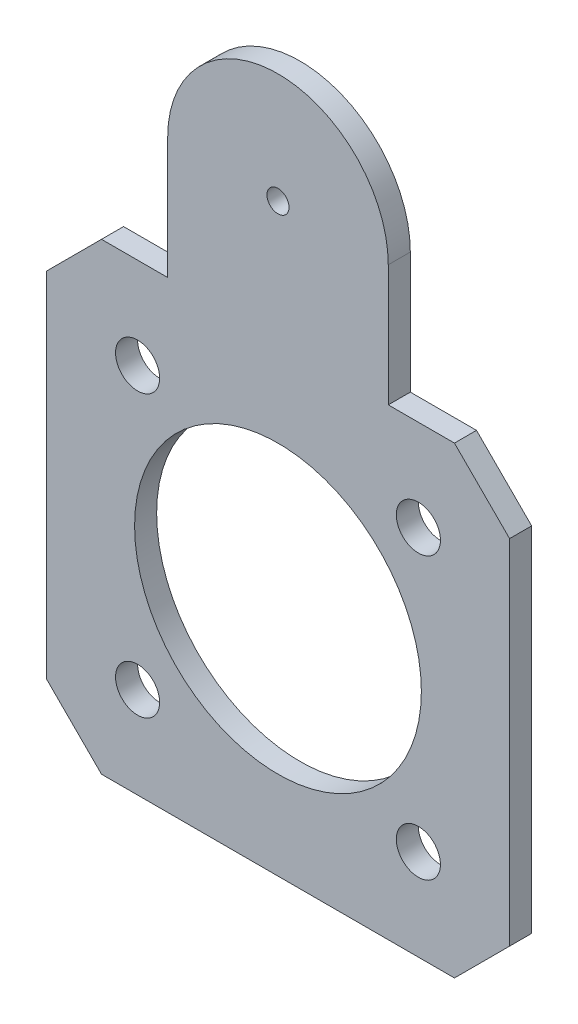
ISO-10303-21;
HEADER;
FILE_DESCRIPTION(('STEP AP214'),'2;1');
FILE_NAME('part.step','',(''),(''),'','','');
FILE_SCHEMA(('AUTOMOTIVE_DESIGN { 1 0 10303 214 1 1 1 1 }'));
ENDSEC;
DATA;
#1=APPLICATION_CONTEXT('core data for automotive mechanical design processes');
#2=APPLICATION_PROTOCOL_DEFINITION('international standard','automotive_design',2000,#1);
#3=PRODUCT_CONTEXT('',#1,'mechanical');
#4=PRODUCT('Part','Part','',(#3));
#5=PRODUCT_RELATED_PRODUCT_CATEGORY('part','',(#4));
#6=PRODUCT_DEFINITION_FORMATION('','',#4);
#7=PRODUCT_DEFINITION_CONTEXT('part definition',#1,'design');
#8=PRODUCT_DEFINITION('design','',#6,#7);
#9=PRODUCT_DEFINITION_SHAPE('','',#8);
#10=(LENGTH_UNIT() NAMED_UNIT(*) SI_UNIT(.MILLI.,.METRE.));
#11=(NAMED_UNIT(*) PLANE_ANGLE_UNIT() SI_UNIT($,.RADIAN.));
#12=(NAMED_UNIT(*) SI_UNIT($,.STERADIAN.) SOLID_ANGLE_UNIT());
#13=UNCERTAINTY_MEASURE_WITH_UNIT(LENGTH_MEASURE(1.E-05),#10,'distance_accuracy_value','');
#14=(GEOMETRIC_REPRESENTATION_CONTEXT(3) GLOBAL_UNCERTAINTY_ASSIGNED_CONTEXT((#13)) GLOBAL_UNIT_ASSIGNED_CONTEXT((#10,
#11,#12)) REPRESENTATION_CONTEXT('',''));
#15=CARTESIAN_POINT('',(0.,0.,0.));
#16=DIRECTION('',(0.,0.,1.));
#17=DIRECTION('',(1.,0.,0.));
#18=AXIS2_PLACEMENT_3D('',#15,#16,#17);
#19=CARTESIAN_POINT('',(0.,32.,2.));
#20=DIRECTION('',(0.,0.,1.));
#21=DIRECTION('',(1.,0.,0.));
#22=AXIS2_PLACEMENT_3D('',#19,#20,#21);
#23=PLANE('',#22);
#24=CARTESIAN_POINT('',(-12.7279220613579,12.7279220613572,2.));
#25=DIRECTION('',(0.,0.,1.));
#26=DIRECTION('',(1.,0.,0.));
#27=AXIS2_PLACEMENT_3D('',#24,#25,#26);
#28=CIRCLE('',#27,2.00000000000076);
#29=CARTESIAN_POINT('',(-10.7279220613571,12.7279220613572,2.));
#30=VERTEX_POINT('',#29);
#31=EDGE_CURVE('E300',#30,#30,#28,.T.);
#32=ORIENTED_EDGE('',*,*,#31,.F.);
#33=EDGE_LOOP('',(#32));
#34=FACE_BOUND('',#33,.T.);
#35=CARTESIAN_POINT('',(12.7279220613586,-12.7279220613579,2.));
#36=DIRECTION('',(0.,0.,1.));
#37=DIRECTION('',(1.,0.,0.));
#38=AXIS2_PLACEMENT_3D('',#35,#36,#37);
#39=CIRCLE('',#38,1.99999999999983);
#40=CARTESIAN_POINT('',(14.7279220613584,-12.7279220613579,2.));
#41=VERTEX_POINT('',#40);
#42=EDGE_CURVE('E312',#41,#41,#39,.T.);
#43=ORIENTED_EDGE('',*,*,#42,.F.);
#44=EDGE_LOOP('',(#43));
#45=FACE_BOUND('',#44,.T.);
#46=CARTESIAN_POINT('',(12.7279220613579,12.7279220613579,2.));
#47=DIRECTION('',(0.,0.,1.));
#48=DIRECTION('',(1.,0.,0.));
#49=AXIS2_PLACEMENT_3D('',#46,#47,#48);
#50=CIRCLE('',#49,2.);
#51=CARTESIAN_POINT('',(14.7279220613579,12.7279220613579,2.));
#52=VERTEX_POINT('',#51);
#53=EDGE_CURVE('E159',#52,#52,#50,.T.);
#54=ORIENTED_EDGE('',*,*,#53,.F.);
#55=EDGE_LOOP('',(#54));
#56=FACE_BOUND('',#55,.T.);
#57=DIRECTION('',(0.,-1.,0.));
#58=VECTOR('',#57,1.);
#59=CARTESIAN_POINT('',(-10.,21.,2.));
#60=LINE('',#59,#58);
#61=CARTESIAN_POINT('',(-10.,32.,2.));
#62=VERTEX_POINT('',#61);
#63=CARTESIAN_POINT('',(-10.,21.,2.));
#64=VERTEX_POINT('',#63);
#65=EDGE_CURVE('E178',#62,#64,#60,.T.);
#66=ORIENTED_EDGE('',*,*,#65,.T.);
#67=DIRECTION('',(-1.,0.,0.));
#68=VECTOR('',#67,1.);
#69=CARTESIAN_POINT('',(-16.,21.,2.));
#70=LINE('',#69,#68);
#71=CARTESIAN_POINT('',(-16.,21.,2.));
#72=VERTEX_POINT('',#71);
#73=EDGE_CURVE('E106',#64,#72,#70,.T.);
#74=ORIENTED_EDGE('',*,*,#73,.T.);
#75=DIRECTION('',(-0.707106781186548,-0.707106781186548,0.));
#76=VECTOR('',#75,1.);
#77=CARTESIAN_POINT('',(-21.,16.,2.));
#78=LINE('',#77,#76);
#79=CARTESIAN_POINT('',(-21.,16.,2.));
#80=VERTEX_POINT('',#79);
#81=EDGE_CURVE('E205',#72,#80,#78,.T.);
#82=ORIENTED_EDGE('',*,*,#81,.T.);
#83=DIRECTION('',(0.,-1.,0.));
#84=VECTOR('',#83,1.);
#85=CARTESIAN_POINT('',(-21.,-16.,2.));
#86=LINE('',#85,#84);
#87=CARTESIAN_POINT('',(-21.,-16.,2.));
#88=VERTEX_POINT('',#87);
#89=EDGE_CURVE('E224',#80,#88,#86,.T.);
#90=ORIENTED_EDGE('',*,*,#89,.T.);
#91=DIRECTION('',(0.707106781186548,-0.707106781186548,0.));
#92=VECTOR('',#91,1.);
#93=CARTESIAN_POINT('',(-21.,-16.,2.));
#94=LINE('',#93,#92);
#95=CARTESIAN_POINT('',(-16.,-21.,2.));
#96=VERTEX_POINT('',#95);
#97=EDGE_CURVE('E221',#88,#96,#94,.T.);
#98=ORIENTED_EDGE('',*,*,#97,.T.);
#99=DIRECTION('',(1.,0.,0.));
#100=VECTOR('',#99,1.);
#101=CARTESIAN_POINT('',(-16.,-21.,2.));
#102=LINE('',#101,#100);
#103=CARTESIAN_POINT('',(16.,-21.,2.));
#104=VERTEX_POINT('',#103);
#105=EDGE_CURVE('E223',#96,#104,#102,.T.);
#106=ORIENTED_EDGE('',*,*,#105,.T.);
#107=DIRECTION('',(0.707106781186548,0.707106781186548,0.));
#108=VECTOR('',#107,1.);
#109=CARTESIAN_POINT('',(16.,-21.,2.));
#110=LINE('',#109,#108);
#111=CARTESIAN_POINT('',(21.,-16.,2.));
#112=VERTEX_POINT('',#111);
#113=EDGE_CURVE('E226',#104,#112,#110,.T.);
#114=ORIENTED_EDGE('',*,*,#113,.T.);
#115=DIRECTION('',(0.,1.,0.));
#116=VECTOR('',#115,1.);
#117=CARTESIAN_POINT('',(21.,-16.,2.));
#118=LINE('',#117,#116);
#119=CARTESIAN_POINT('',(21.,16.,2.));
#120=VERTEX_POINT('',#119);
#121=EDGE_CURVE('E232',#112,#120,#118,.T.);
#122=ORIENTED_EDGE('',*,*,#121,.T.);
#123=DIRECTION('',(-0.707106781186548,0.707106781186548,0.));
#124=VECTOR('',#123,1.);
#125=CARTESIAN_POINT('',(16.,21.,2.));
#126=LINE('',#125,#124);
#127=CARTESIAN_POINT('',(16.,21.,2.));
#128=VERTEX_POINT('',#127);
#129=EDGE_CURVE('E137',#120,#128,#126,.T.);
#130=ORIENTED_EDGE('',*,*,#129,.T.);
#131=DIRECTION('',(-1.,0.,0.));
#132=VECTOR('',#131,1.);
#133=CARTESIAN_POINT('',(10.,21.,2.));
#134=LINE('',#133,#132);
#135=CARTESIAN_POINT('',(10.,21.,2.));
#136=VERTEX_POINT('',#135);
#137=EDGE_CURVE('E131',#128,#136,#134,.T.);
#138=ORIENTED_EDGE('',*,*,#137,.T.);
#139=DIRECTION('',(0.,1.,0.));
#140=VECTOR('',#139,1.);
#141=CARTESIAN_POINT('',(10.,21.,2.));
#142=LINE('',#141,#140);
#143=CARTESIAN_POINT('',(10.,32.,2.));
#144=VERTEX_POINT('',#143);
#145=EDGE_CURVE('E135',#136,#144,#142,.T.);
#146=ORIENTED_EDGE('',*,*,#145,.T.);
#147=CARTESIAN_POINT('',(0.,32.,2.));
#148=DIRECTION('',(0.,0.,1.));
#149=DIRECTION('',(1.,0.,0.));
#150=AXIS2_PLACEMENT_3D('',#147,#148,#149);
#151=CIRCLE('',#150,10.);
#152=EDGE_CURVE('E51',#144,#62,#151,.T.);
#153=ORIENTED_EDGE('',*,*,#152,.T.);
#154=EDGE_LOOP('',(#66,#74,#82,#90,#98,#106,#114,#122,#130,#138,#146,#153));
#155=FACE_BOUND('',#154,.T.);
#156=CARTESIAN_POINT('',(0.,0.,2.));
#157=DIRECTION('',(0.,0.,1.));
#158=DIRECTION('',(1.,0.,0.));
#159=AXIS2_PLACEMENT_3D('',#156,#157,#158);
#160=CIRCLE('',#159,13.);
#161=CARTESIAN_POINT('',(13.,0.,2.));
#162=VERTEX_POINT('',#161);
#163=EDGE_CURVE('E318',#162,#162,#160,.T.);
#164=ORIENTED_EDGE('',*,*,#163,.F.);
#165=EDGE_LOOP('',(#164));
#166=FACE_BOUND('',#165,.T.);
#167=CARTESIAN_POINT('',(-12.7279220613572,-12.7279220613586,2.));
#168=DIRECTION('',(0.,0.,1.));
#169=DIRECTION('',(1.,0.,0.));
#170=AXIS2_PLACEMENT_3D('',#167,#168,#169);
#171=CIRCLE('',#170,2.00000000000052);
#172=CARTESIAN_POINT('',(-10.7279220613566,-12.7279220613586,2.));
#173=VERTEX_POINT('',#172);
#174=EDGE_CURVE('E306',#173,#173,#171,.T.);
#175=ORIENTED_EDGE('',*,*,#174,.F.);
#176=EDGE_LOOP('',(#175));
#177=FACE_BOUND('',#176,.T.);
#178=CARTESIAN_POINT('',(0.,32.,2.));
#179=DIRECTION('',(0.,0.,1.));
#180=DIRECTION('',(1.,0.,0.));
#181=AXIS2_PLACEMENT_3D('',#178,#179,#180);
#182=CIRCLE('',#181,1.);
#183=CARTESIAN_POINT('',(1.,32.,2.));
#184=VERTEX_POINT('',#183);
#185=EDGE_CURVE('E291',#184,#184,#182,.T.);
#186=ORIENTED_EDGE('',*,*,#185,.F.);
#187=EDGE_LOOP('',(#186));
#188=FACE_BOUND('',#187,.T.);
#189=ADVANCED_FACE('F34',(#34,#45,#56,#155,#166,#177,#188),#23,.T.);
#190=CARTESIAN_POINT('',(0.,32.,0.));
#191=DIRECTION('',(0.,0.,1.));
#192=DIRECTION('',(1.,0.,0.));
#193=AXIS2_PLACEMENT_3D('',#190,#191,#192);
#194=PLANE('',#193);
#195=DIRECTION('',(0.,-1.,0.));
#196=VECTOR('',#195,1.);
#197=CARTESIAN_POINT('',(-10.,21.,0.));
#198=LINE('',#197,#196);
#199=CARTESIAN_POINT('',(-10.,32.,0.));
#200=VERTEX_POINT('',#199);
#201=CARTESIAN_POINT('',(-10.,21.,0.));
#202=VERTEX_POINT('',#201);
#203=EDGE_CURVE('E155',#200,#202,#198,.T.);
#204=ORIENTED_EDGE('',*,*,#203,.F.);
#205=CARTESIAN_POINT('',(0.,32.,0.));
#206=DIRECTION('',(0.,0.,1.));
#207=DIRECTION('',(1.,0.,0.));
#208=AXIS2_PLACEMENT_3D('',#205,#206,#207);
#209=CIRCLE('',#208,10.);
#210=CARTESIAN_POINT('',(10.,32.,0.));
#211=VERTEX_POINT('',#210);
#212=EDGE_CURVE('E98',#211,#200,#209,.T.);
#213=ORIENTED_EDGE('',*,*,#212,.F.);
#214=DIRECTION('',(0.,1.,0.));
#215=VECTOR('',#214,1.);
#216=CARTESIAN_POINT('',(10.,21.,0.));
#217=LINE('',#216,#215);
#218=CARTESIAN_POINT('',(10.,21.,0.));
#219=VERTEX_POINT('',#218);
#220=EDGE_CURVE('E92',#219,#211,#217,.T.);
#221=ORIENTED_EDGE('',*,*,#220,.F.);
#222=DIRECTION('',(-1.,0.,0.));
#223=VECTOR('',#222,1.);
#224=CARTESIAN_POINT('',(10.,21.,0.));
#225=LINE('',#224,#223);
#226=CARTESIAN_POINT('',(16.,21.,0.));
#227=VERTEX_POINT('',#226);
#228=EDGE_CURVE('E145',#227,#219,#225,.T.);
#229=ORIENTED_EDGE('',*,*,#228,.F.);
#230=DIRECTION('',(-0.707106781186548,0.707106781186548,0.));
#231=VECTOR('',#230,1.);
#232=CARTESIAN_POINT('',(16.,21.,0.));
#233=LINE('',#232,#231);
#234=CARTESIAN_POINT('',(21.,16.,0.));
#235=VERTEX_POINT('',#234);
#236=EDGE_CURVE('E173',#235,#227,#233,.T.);
#237=ORIENTED_EDGE('',*,*,#236,.F.);
#238=DIRECTION('',(0.,1.,0.));
#239=VECTOR('',#238,1.);
#240=CARTESIAN_POINT('',(21.,-16.,0.));
#241=LINE('',#240,#239);
#242=CARTESIAN_POINT('',(21.,-16.,0.));
#243=VERTEX_POINT('',#242);
#244=EDGE_CURVE('E171',#243,#235,#241,.T.);
#245=ORIENTED_EDGE('',*,*,#244,.F.);
#246=DIRECTION('',(0.707106781186548,0.707106781186548,0.));
#247=VECTOR('',#246,1.);
#248=CARTESIAN_POINT('',(16.,-21.,0.));
#249=LINE('',#248,#247);
#250=CARTESIAN_POINT('',(16.,-21.,0.));
#251=VERTEX_POINT('',#250);
#252=EDGE_CURVE('E169',#251,#243,#249,.T.);
#253=ORIENTED_EDGE('',*,*,#252,.F.);
#254=DIRECTION('',(1.,0.,0.));
#255=VECTOR('',#254,1.);
#256=CARTESIAN_POINT('',(-16.,-21.,0.));
#257=LINE('',#256,#255);
#258=CARTESIAN_POINT('',(-16.,-21.,0.));
#259=VERTEX_POINT('',#258);
#260=EDGE_CURVE('E167',#259,#251,#257,.T.);
#261=ORIENTED_EDGE('',*,*,#260,.F.);
#262=DIRECTION('',(0.707106781186548,-0.707106781186548,0.));
#263=VECTOR('',#262,1.);
#264=CARTESIAN_POINT('',(-21.,-16.,0.));
#265=LINE('',#264,#263);
#266=CARTESIAN_POINT('',(-21.,-16.,0.));
#267=VERTEX_POINT('',#266);
#268=EDGE_CURVE('E165',#267,#259,#265,.T.);
#269=ORIENTED_EDGE('',*,*,#268,.F.);
#270=DIRECTION('',(0.,-1.,0.));
#271=VECTOR('',#270,1.);
#272=CARTESIAN_POINT('',(-21.,-16.,0.));
#273=LINE('',#272,#271);
#274=CARTESIAN_POINT('',(-21.,16.,0.));
#275=VERTEX_POINT('',#274);
#276=EDGE_CURVE('E163',#275,#267,#273,.T.);
#277=ORIENTED_EDGE('',*,*,#276,.F.);
#278=DIRECTION('',(-0.707106781186548,-0.707106781186548,0.));
#279=VECTOR('',#278,1.);
#280=CARTESIAN_POINT('',(-21.,16.,0.));
#281=LINE('',#280,#279);
#282=CARTESIAN_POINT('',(-16.,21.,0.));
#283=VERTEX_POINT('',#282);
#284=EDGE_CURVE('E161',#283,#275,#281,.T.);
#285=ORIENTED_EDGE('',*,*,#284,.F.);
#286=DIRECTION('',(-1.,0.,0.));
#287=VECTOR('',#286,1.);
#288=CARTESIAN_POINT('',(-16.,21.,0.));
#289=LINE('',#288,#287);
#290=EDGE_CURVE('E158',#202,#283,#289,.T.);
#291=ORIENTED_EDGE('',*,*,#290,.F.);
#292=EDGE_LOOP('',(#204,#213,#221,#229,#237,#245,#253,#261,#269,#277,#285,#291));
#293=FACE_BOUND('',#292,.T.);
#294=CARTESIAN_POINT('',(12.7279220613579,12.7279220613579,0.));
#295=DIRECTION('',(0.,0.,1.));
#296=DIRECTION('',(1.,0.,0.));
#297=AXIS2_PLACEMENT_3D('',#294,#295,#296);
#298=CIRCLE('',#297,2.);
#299=CARTESIAN_POINT('',(14.7279220613579,12.7279220613579,0.));
#300=VERTEX_POINT('',#299);
#301=EDGE_CURVE('E321',#300,#300,#298,.T.);
#302=ORIENTED_EDGE('',*,*,#301,.T.);
#303=EDGE_LOOP('',(#302));
#304=FACE_BOUND('',#303,.T.);
#305=CARTESIAN_POINT('',(0.,0.,0.));
#306=DIRECTION('',(0.,0.,1.));
#307=DIRECTION('',(1.,0.,0.));
#308=AXIS2_PLACEMENT_3D('',#305,#306,#307);
#309=CIRCLE('',#308,13.);
#310=CARTESIAN_POINT('',(13.,0.,0.));
#311=VERTEX_POINT('',#310);
#312=EDGE_CURVE('E315',#311,#311,#309,.T.);
#313=ORIENTED_EDGE('',*,*,#312,.T.);
#314=EDGE_LOOP('',(#313));
#315=FACE_BOUND('',#314,.T.);
#316=CARTESIAN_POINT('',(12.7279220613586,-12.7279220613579,0.));
#317=DIRECTION('',(0.,0.,1.));
#318=DIRECTION('',(1.,0.,0.));
#319=AXIS2_PLACEMENT_3D('',#316,#317,#318);
#320=CIRCLE('',#319,1.99999999999983);
#321=CARTESIAN_POINT('',(14.7279220613584,-12.7279220613579,0.));
#322=VERTEX_POINT('',#321);
#323=EDGE_CURVE('E309',#322,#322,#320,.T.);
#324=ORIENTED_EDGE('',*,*,#323,.T.);
#325=EDGE_LOOP('',(#324));
#326=FACE_BOUND('',#325,.T.);
#327=CARTESIAN_POINT('',(-12.7279220613572,-12.7279220613586,0.));
#328=DIRECTION('',(0.,0.,1.));
#329=DIRECTION('',(1.,0.,0.));
#330=AXIS2_PLACEMENT_3D('',#327,#328,#329);
#331=CIRCLE('',#330,2.00000000000052);
#332=CARTESIAN_POINT('',(-10.7279220613566,-12.7279220613586,0.));
#333=VERTEX_POINT('',#332);
#334=EDGE_CURVE('E303',#333,#333,#331,.T.);
#335=ORIENTED_EDGE('',*,*,#334,.T.);
#336=EDGE_LOOP('',(#335));
#337=FACE_BOUND('',#336,.T.);
#338=CARTESIAN_POINT('',(-12.7279220613579,12.7279220613572,0.));
#339=DIRECTION('',(0.,0.,1.));
#340=DIRECTION('',(1.,0.,0.));
#341=AXIS2_PLACEMENT_3D('',#338,#339,#340);
#342=CIRCLE('',#341,2.00000000000076);
#343=CARTESIAN_POINT('',(-10.7279220613571,12.7279220613572,0.));
#344=VERTEX_POINT('',#343);
#345=EDGE_CURVE('E297',#344,#344,#342,.T.);
#346=ORIENTED_EDGE('',*,*,#345,.T.);
#347=EDGE_LOOP('',(#346));
#348=FACE_BOUND('',#347,.T.);
#349=CARTESIAN_POINT('',(0.,32.,0.));
#350=DIRECTION('',(0.,0.,1.));
#351=DIRECTION('',(1.,0.,0.));
#352=AXIS2_PLACEMENT_3D('',#349,#350,#351);
#353=CIRCLE('',#352,1.);
#354=CARTESIAN_POINT('',(1.,32.,0.));
#355=VERTEX_POINT('',#354);
#356=EDGE_CURVE('E294',#355,#355,#353,.T.);
#357=ORIENTED_EDGE('',*,*,#356,.T.);
#358=EDGE_LOOP('',(#357));
#359=FACE_BOUND('',#358,.T.);
#360=ADVANCED_FACE('F209',(#293,#304,#315,#326,#337,#348,#359),#194,.F.);
#361=CARTESIAN_POINT('',(-10.,21.,2.));
#362=DIRECTION('',(1.,0.,0.));
#363=DIRECTION('',(0.,0.,-1.));
#364=AXIS2_PLACEMENT_3D('',#361,#362,#363);
#365=PLANE('',#364);
#366=ORIENTED_EDGE('',*,*,#203,.T.);
#367=DIRECTION('',(0.,0.,-1.));
#368=VECTOR('',#367,1.);
#369=CARTESIAN_POINT('',(-10.,21.,2.));
#370=LINE('',#369,#368);
#371=EDGE_CURVE('E11',#64,#202,#370,.T.);
#372=ORIENTED_EDGE('',*,*,#371,.F.);
#373=ORIENTED_EDGE('',*,*,#65,.F.);
#374=DIRECTION('',(0.,0.,-1.));
#375=VECTOR('',#374,1.);
#376=CARTESIAN_POINT('',(-10.,32.,2.));
#377=LINE('',#376,#375);
#378=EDGE_CURVE('E151',#62,#200,#377,.T.);
#379=ORIENTED_EDGE('',*,*,#378,.T.);
#380=EDGE_LOOP('',(#366,#372,#373,#379));
#381=FACE_BOUND('',#380,.T.);
#382=ADVANCED_FACE('F36',(#381),#365,.F.);
#383=CARTESIAN_POINT('',(-16.,21.,2.));
#384=DIRECTION('',(0.,-1.,0.));
#385=DIRECTION('',(0.,0.,-1.));
#386=AXIS2_PLACEMENT_3D('',#383,#384,#385);
#387=PLANE('',#386);
#388=ORIENTED_EDGE('',*,*,#290,.T.);
#389=DIRECTION('',(0.,0.,-1.));
#390=VECTOR('',#389,1.);
#391=CARTESIAN_POINT('',(-16.,21.,2.));
#392=LINE('',#391,#390);
#393=EDGE_CURVE('E43',#72,#283,#392,.T.);
#394=ORIENTED_EDGE('',*,*,#393,.F.);
#395=ORIENTED_EDGE('',*,*,#73,.F.);
#396=ORIENTED_EDGE('',*,*,#371,.T.);
#397=EDGE_LOOP('',(#388,#394,#395,#396));
#398=FACE_BOUND('',#397,.T.);
#399=ADVANCED_FACE('F449',(#398),#387,.F.);
#400=CARTESIAN_POINT('',(-21.,16.,2.));
#401=DIRECTION('',(0.707106781186547,-0.707106781186547,0.));
#402=DIRECTION('',(0.707106781186548,0.707106781186548,0.));
#403=AXIS2_PLACEMENT_3D('',#400,#401,#402);
#404=PLANE('',#403);
#405=ORIENTED_EDGE('',*,*,#284,.T.);
#406=DIRECTION('',(0.,0.,-1.));
#407=VECTOR('',#406,1.);
#408=CARTESIAN_POINT('',(-21.,16.,2.));
#409=LINE('',#408,#407);
#410=EDGE_CURVE('E197',#80,#275,#409,.T.);
#411=ORIENTED_EDGE('',*,*,#410,.F.);
#412=ORIENTED_EDGE('',*,*,#81,.F.);
#413=ORIENTED_EDGE('',*,*,#393,.T.);
#414=EDGE_LOOP('',(#405,#411,#412,#413));
#415=FACE_BOUND('',#414,.T.);
#416=ADVANCED_FACE('F203',(#415),#404,.F.);
#417=CARTESIAN_POINT('',(-21.,-16.,2.));
#418=DIRECTION('',(1.,0.,0.));
#419=DIRECTION('',(0.,0.,-1.));
#420=AXIS2_PLACEMENT_3D('',#417,#418,#419);
#421=PLANE('',#420);
#422=ORIENTED_EDGE('',*,*,#276,.T.);
#423=DIRECTION('',(0.,0.,-1.));
#424=VECTOR('',#423,1.);
#425=CARTESIAN_POINT('',(-21.,-16.,2.));
#426=LINE('',#425,#424);
#427=EDGE_CURVE('E194',#88,#267,#426,.T.);
#428=ORIENTED_EDGE('',*,*,#427,.F.);
#429=ORIENTED_EDGE('',*,*,#89,.F.);
#430=ORIENTED_EDGE('',*,*,#410,.T.);
#431=EDGE_LOOP('',(#422,#428,#429,#430));
#432=FACE_BOUND('',#431,.T.);
#433=ADVANCED_FACE('F215',(#432),#421,.F.);
#434=CARTESIAN_POINT('',(-21.,-16.,2.));
#435=DIRECTION('',(0.707106781186547,0.707106781186547,0.));
#436=DIRECTION('',(-0.707106781186548,0.707106781186548,0.));
#437=AXIS2_PLACEMENT_3D('',#434,#435,#436);
#438=PLANE('',#437);
#439=ORIENTED_EDGE('',*,*,#268,.T.);
#440=DIRECTION('',(0.,0.,-1.));
#441=VECTOR('',#440,1.);
#442=CARTESIAN_POINT('',(-16.,-21.,2.));
#443=LINE('',#442,#441);
#444=EDGE_CURVE('E191',#96,#259,#443,.T.);
#445=ORIENTED_EDGE('',*,*,#444,.F.);
#446=ORIENTED_EDGE('',*,*,#97,.F.);
#447=ORIENTED_EDGE('',*,*,#427,.T.);
#448=EDGE_LOOP('',(#439,#445,#446,#447));
#449=FACE_BOUND('',#448,.T.);
#450=ADVANCED_FACE('F219',(#449),#438,.F.);
#451=CARTESIAN_POINT('',(-16.,-21.,2.));
#452=DIRECTION('',(0.,1.,0.));
#453=DIRECTION('',(0.,0.,1.));
#454=AXIS2_PLACEMENT_3D('',#451,#452,#453);
#455=PLANE('',#454);
#456=ORIENTED_EDGE('',*,*,#260,.T.);
#457=DIRECTION('',(0.,0.,-1.));
#458=VECTOR('',#457,1.);
#459=CARTESIAN_POINT('',(16.,-21.,2.));
#460=LINE('',#459,#458);
#461=EDGE_CURVE('E188',#104,#251,#460,.T.);
#462=ORIENTED_EDGE('',*,*,#461,.F.);
#463=ORIENTED_EDGE('',*,*,#105,.F.);
#464=ORIENTED_EDGE('',*,*,#444,.T.);
#465=EDGE_LOOP('',(#456,#462,#463,#464));
#466=FACE_BOUND('',#465,.T.);
#467=ADVANCED_FACE('F414',(#466),#455,.F.);
#468=CARTESIAN_POINT('',(16.,-21.,2.));
#469=DIRECTION('',(-0.707106781186547,0.707106781186547,0.));
#470=DIRECTION('',(-0.707106781186548,-0.707106781186548,0.));
#471=AXIS2_PLACEMENT_3D('',#468,#469,#470);
#472=PLANE('',#471);
#473=ORIENTED_EDGE('',*,*,#252,.T.);
#474=DIRECTION('',(0.,0.,-1.));
#475=VECTOR('',#474,1.);
#476=CARTESIAN_POINT('',(21.,-16.,2.));
#477=LINE('',#476,#475);
#478=EDGE_CURVE('E185',#112,#243,#477,.T.);
#479=ORIENTED_EDGE('',*,*,#478,.F.);
#480=ORIENTED_EDGE('',*,*,#113,.F.);
#481=ORIENTED_EDGE('',*,*,#461,.T.);
#482=EDGE_LOOP('',(#473,#479,#480,#481));
#483=FACE_BOUND('',#482,.T.);
#484=ADVANCED_FACE('F405',(#483),#472,.F.);
#485=CARTESIAN_POINT('',(21.,-16.,2.));
#486=DIRECTION('',(-1.,0.,0.));
#487=DIRECTION('',(0.,0.,1.));
#488=AXIS2_PLACEMENT_3D('',#485,#486,#487);
#489=PLANE('',#488);
#490=ORIENTED_EDGE('',*,*,#244,.T.);
#491=DIRECTION('',(0.,0.,-1.));
#492=VECTOR('',#491,1.);
#493=CARTESIAN_POINT('',(21.,16.,2.));
#494=LINE('',#493,#492);
#495=EDGE_CURVE('E182',#120,#235,#494,.T.);
#496=ORIENTED_EDGE('',*,*,#495,.F.);
#497=ORIENTED_EDGE('',*,*,#121,.F.);
#498=ORIENTED_EDGE('',*,*,#478,.T.);
#499=EDGE_LOOP('',(#490,#496,#497,#498));
#500=FACE_BOUND('',#499,.T.);
#501=ADVANCED_FACE('F238',(#500),#489,.F.);
#502=CARTESIAN_POINT('',(16.,21.,2.));
#503=DIRECTION('',(-0.707106781186547,-0.707106781186547,0.));
#504=DIRECTION('',(0.707106781186548,-0.707106781186548,0.));
#505=AXIS2_PLACEMENT_3D('',#502,#503,#504);
#506=PLANE('',#505);
#507=ORIENTED_EDGE('',*,*,#236,.T.);
#508=DIRECTION('',(0.,0.,-1.));
#509=VECTOR('',#508,1.);
#510=CARTESIAN_POINT('',(16.,21.,2.));
#511=LINE('',#510,#509);
#512=EDGE_CURVE('E146',#128,#227,#511,.T.);
#513=ORIENTED_EDGE('',*,*,#512,.F.);
#514=ORIENTED_EDGE('',*,*,#129,.F.);
#515=ORIENTED_EDGE('',*,*,#495,.T.);
#516=EDGE_LOOP('',(#507,#513,#514,#515));
#517=FACE_BOUND('',#516,.T.);
#518=ADVANCED_FACE('F242',(#517),#506,.F.);
#519=CARTESIAN_POINT('',(10.,21.,2.));
#520=DIRECTION('',(0.,-1.,0.));
#521=DIRECTION('',(0.,0.,-1.));
#522=AXIS2_PLACEMENT_3D('',#519,#520,#521);
#523=PLANE('',#522);
#524=ORIENTED_EDGE('',*,*,#228,.T.);
#525=DIRECTION('',(0.,0.,-1.));
#526=VECTOR('',#525,1.);
#527=CARTESIAN_POINT('',(10.,21.,2.));
#528=LINE('',#527,#526);
#529=EDGE_CURVE('E142',#136,#219,#528,.T.);
#530=ORIENTED_EDGE('',*,*,#529,.F.);
#531=ORIENTED_EDGE('',*,*,#137,.F.);
#532=ORIENTED_EDGE('',*,*,#512,.T.);
#533=EDGE_LOOP('',(#524,#530,#531,#532));
#534=FACE_BOUND('',#533,.T.);
#535=ADVANCED_FACE('F143',(#534),#523,.F.);
#536=CARTESIAN_POINT('',(10.,21.,2.));
#537=DIRECTION('',(-1.,0.,0.));
#538=DIRECTION('',(0.,0.,1.));
#539=AXIS2_PLACEMENT_3D('',#536,#537,#538);
#540=PLANE('',#539);
#541=ORIENTED_EDGE('',*,*,#220,.T.);
#542=DIRECTION('',(0.,0.,-1.));
#543=VECTOR('',#542,1.);
#544=CARTESIAN_POINT('',(10.,32.,2.));
#545=LINE('',#544,#543);
#546=EDGE_CURVE('E147',#144,#211,#545,.T.);
#547=ORIENTED_EDGE('',*,*,#546,.F.);
#548=ORIENTED_EDGE('',*,*,#145,.F.);
#549=ORIENTED_EDGE('',*,*,#529,.T.);
#550=EDGE_LOOP('',(#541,#547,#548,#549));
#551=FACE_BOUND('',#550,.T.);
#552=ADVANCED_FACE('F149',(#551),#540,.F.);
#553=CARTESIAN_POINT('',(0.,32.,2.));
#554=DIRECTION('',(0.,0.,-1.));
#555=DIRECTION('',(-1.,0.,0.));
#556=AXIS2_PLACEMENT_3D('',#553,#554,#555);
#557=CYLINDRICAL_SURFACE('',#556,10.);
#558=ORIENTED_EDGE('',*,*,#212,.T.);
#559=ORIENTED_EDGE('',*,*,#378,.F.);
#560=ORIENTED_EDGE('',*,*,#152,.F.);
#561=ORIENTED_EDGE('',*,*,#546,.T.);
#562=EDGE_LOOP('',(#558,#559,#560,#561));
#563=FACE_BOUND('',#562,.T.);
#564=ADVANCED_FACE('F246',(#563),#557,.T.);
#565=CARTESIAN_POINT('',(12.7279220613579,12.7279220613579,2.));
#566=DIRECTION('',(0.,0.,-1.));
#567=DIRECTION('',(-1.,0.,0.));
#568=AXIS2_PLACEMENT_3D('',#565,#566,#567);
#569=CYLINDRICAL_SURFACE('',#568,2.);
#570=ORIENTED_EDGE('',*,*,#53,.T.);
#571=EDGE_LOOP('',(#570));
#572=FACE_BOUND('',#571,.T.);
#573=ORIENTED_EDGE('',*,*,#301,.F.);
#574=EDGE_LOOP('',(#573));
#575=FACE_BOUND('',#574,.T.);
#576=ADVANCED_FACE('F248',(#572,#575),#569,.F.);
#577=CARTESIAN_POINT('',(0.,0.,2.));
#578=DIRECTION('',(0.,0.,-1.));
#579=DIRECTION('',(-1.,0.,0.));
#580=AXIS2_PLACEMENT_3D('',#577,#578,#579);
#581=CYLINDRICAL_SURFACE('',#580,13.);
#582=ORIENTED_EDGE('',*,*,#163,.T.);
#583=EDGE_LOOP('',(#582));
#584=FACE_BOUND('',#583,.T.);
#585=ORIENTED_EDGE('',*,*,#312,.F.);
#586=EDGE_LOOP('',(#585));
#587=FACE_BOUND('',#586,.T.);
#588=ADVANCED_FACE('F254',(#584,#587),#581,.F.);
#589=CARTESIAN_POINT('',(12.7279220613586,-12.7279220613579,2.));
#590=DIRECTION('',(0.,0.,-1.));
#591=DIRECTION('',(-1.,0.,0.));
#592=AXIS2_PLACEMENT_3D('',#589,#590,#591);
#593=CYLINDRICAL_SURFACE('',#592,1.99999999999983);
#594=ORIENTED_EDGE('',*,*,#42,.T.);
#595=EDGE_LOOP('',(#594));
#596=FACE_BOUND('',#595,.T.);
#597=ORIENTED_EDGE('',*,*,#323,.F.);
#598=EDGE_LOOP('',(#597));
#599=FACE_BOUND('',#598,.T.);
#600=ADVANCED_FACE('F270',(#596,#599),#593,.F.);
#601=CARTESIAN_POINT('',(-12.7279220613572,-12.7279220613586,2.));
#602=DIRECTION('',(0.,0.,-1.));
#603=DIRECTION('',(-1.,0.,0.));
#604=AXIS2_PLACEMENT_3D('',#601,#602,#603);
#605=CYLINDRICAL_SURFACE('',#604,2.00000000000052);
#606=ORIENTED_EDGE('',*,*,#174,.T.);
#607=EDGE_LOOP('',(#606));
#608=FACE_BOUND('',#607,.T.);
#609=ORIENTED_EDGE('',*,*,#334,.F.);
#610=EDGE_LOOP('',(#609));
#611=FACE_BOUND('',#610,.T.);
#612=ADVANCED_FACE('F274',(#608,#611),#605,.F.);
#613=CARTESIAN_POINT('',(-12.7279220613579,12.7279220613572,2.));
#614=DIRECTION('',(0.,0.,-1.));
#615=DIRECTION('',(-1.,0.,0.));
#616=AXIS2_PLACEMENT_3D('',#613,#614,#615);
#617=CYLINDRICAL_SURFACE('',#616,2.00000000000076);
#618=ORIENTED_EDGE('',*,*,#31,.T.);
#619=EDGE_LOOP('',(#618));
#620=FACE_BOUND('',#619,.T.);
#621=ORIENTED_EDGE('',*,*,#345,.F.);
#622=EDGE_LOOP('',(#621));
#623=FACE_BOUND('',#622,.T.);
#624=ADVANCED_FACE('F278',(#620,#623),#617,.F.);
#625=CARTESIAN_POINT('',(0.,32.,2.));
#626=DIRECTION('',(0.,0.,-1.));
#627=DIRECTION('',(-1.,0.,0.));
#628=AXIS2_PLACEMENT_3D('',#625,#626,#627);
#629=CYLINDRICAL_SURFACE('',#628,1.);
#630=ORIENTED_EDGE('',*,*,#185,.T.);
#631=EDGE_LOOP('',(#630));
#632=FACE_BOUND('',#631,.T.);
#633=ORIENTED_EDGE('',*,*,#356,.F.);
#634=EDGE_LOOP('',(#633));
#635=FACE_BOUND('',#634,.T.);
#636=ADVANCED_FACE('F282',(#632,#635),#629,.F.);
#637=CLOSED_SHELL('',(#189,#360,#382,#399,#416,#433,#450,#467,#484,#501,#518,#535,#552,#564,
#576,#588,#600,#612,#624,#636));
#638=MANIFOLD_SOLID_BREP('B2',#637);
#639=ADVANCED_BREP_SHAPE_REPRESENTATION('',(#18,#638),#14);
#640=SHAPE_DEFINITION_REPRESENTATION(#9,#639);
ENDSEC;
END-ISO-10303-21;
